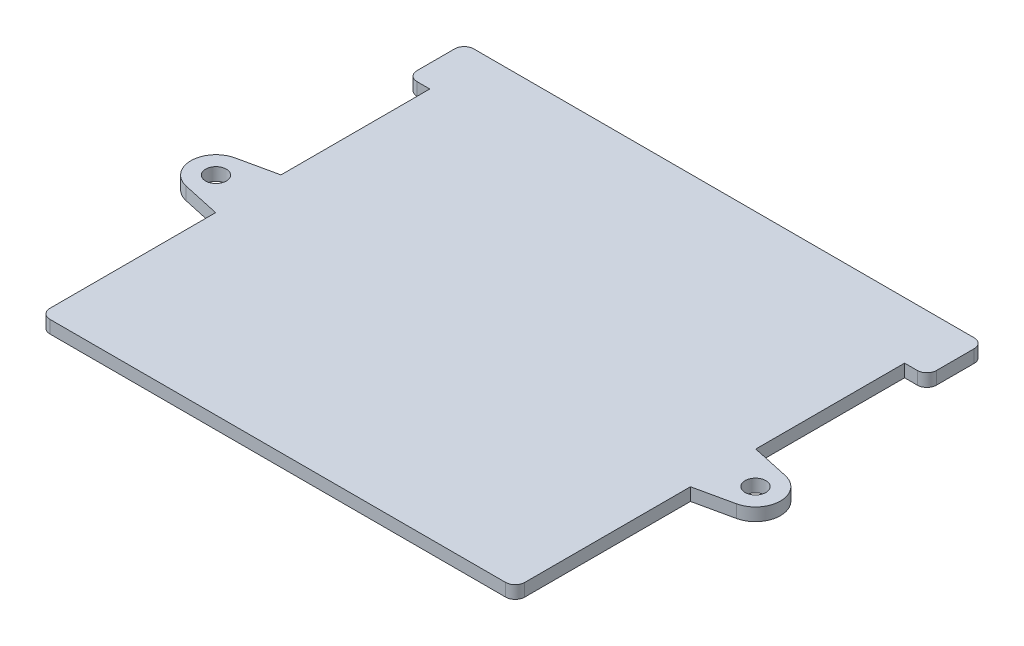
ISO-10303-21;
HEADER;
FILE_DESCRIPTION(('STEP AP214'),'2;1');
FILE_NAME('part.step','',(''),(''),'','','');
FILE_SCHEMA(('AUTOMOTIVE_DESIGN { 1 0 10303 214 1 1 1 1 }'));
ENDSEC;
DATA;
#1=APPLICATION_CONTEXT('core data for automotive mechanical design processes');
#2=APPLICATION_PROTOCOL_DEFINITION('international standard','automotive_design',2000,#1);
#3=PRODUCT_CONTEXT('',#1,'mechanical');
#4=PRODUCT('Part','Part','',(#3));
#5=PRODUCT_RELATED_PRODUCT_CATEGORY('part','',(#4));
#6=PRODUCT_DEFINITION_FORMATION('','',#4);
#7=PRODUCT_DEFINITION_CONTEXT('part definition',#1,'design');
#8=PRODUCT_DEFINITION('design','',#6,#7);
#9=PRODUCT_DEFINITION_SHAPE('','',#8);
#10=(LENGTH_UNIT() NAMED_UNIT(*) SI_UNIT(.MILLI.,.METRE.));
#11=(NAMED_UNIT(*) PLANE_ANGLE_UNIT() SI_UNIT($,.RADIAN.));
#12=(NAMED_UNIT(*) SI_UNIT($,.STERADIAN.) SOLID_ANGLE_UNIT());
#13=UNCERTAINTY_MEASURE_WITH_UNIT(LENGTH_MEASURE(1.E-05),#10,'distance_accuracy_value','');
#14=(GEOMETRIC_REPRESENTATION_CONTEXT(3) GLOBAL_UNCERTAINTY_ASSIGNED_CONTEXT((#13)) GLOBAL_UNIT_ASSIGNED_CONTEXT((#10,
#11,#12)) REPRESENTATION_CONTEXT('',''));
#15=CARTESIAN_POINT('',(0.,0.,0.));
#16=DIRECTION('',(0.,0.,1.));
#17=DIRECTION('',(1.,0.,0.));
#18=AXIS2_PLACEMENT_3D('',#15,#16,#17);
#19=CARTESIAN_POINT('',(84.65,4.,-65.25));
#20=DIRECTION('',(0.,1.,0.));
#21=DIRECTION('',(0.,0.,1.));
#22=AXIS2_PLACEMENT_3D('',#19,#20,#21);
#23=PLANE('',#22);
#24=CARTESIAN_POINT('',(84.65,4.,-65.25));
#25=DIRECTION('',(0.,1.,0.));
#26=DIRECTION('',(0.,0.,1.));
#27=AXIS2_PLACEMENT_3D('',#24,#25,#26);
#28=CIRCLE('',#27,3.25000000000001);
#29=CARTESIAN_POINT('',(84.65,4.,-62.));
#30=VERTEX_POINT('',#29);
#31=EDGE_CURVE('E385',#30,#30,#28,.T.);
#32=ORIENTED_EDGE('',*,*,#31,.F.);
#33=EDGE_LOOP('',(#32));
#34=FACE_BOUND('',#33,.T.);
#35=DIRECTION('',(1.,0.,0.));
#36=VECTOR('',#35,1.);
#37=CARTESIAN_POINT('',(74.5,4.,0.));
#38=LINE('',#37,#36);
#39=CARTESIAN_POINT('',(-71.5,4.,0.));
#40=VERTEX_POINT('',#39);
#41=CARTESIAN_POINT('',(71.5,4.,0.));
#42=VERTEX_POINT('',#41);
#43=EDGE_CURVE('E308',#40,#42,#38,.T.);
#44=ORIENTED_EDGE('',*,*,#43,.T.);
#45=CARTESIAN_POINT('',(71.5,4.,-2.99999999999998));
#46=DIRECTION('',(0.,1.,0.));
#47=DIRECTION('',(0.,0.,1.));
#48=AXIS2_PLACEMENT_3D('',#45,#46,#47);
#49=CIRCLE('',#48,3.);
#50=CARTESIAN_POINT('',(74.5,4.,-2.99999999999998));
#51=VERTEX_POINT('',#50);
#52=EDGE_CURVE('E199',#42,#51,#49,.T.);
#53=ORIENTED_EDGE('',*,*,#52,.T.);
#54=DIRECTION('',(0.,0.,-1.));
#55=VECTOR('',#54,1.);
#56=CARTESIAN_POINT('',(74.5,4.,0.));
#57=LINE('',#56,#55);
#58=CARTESIAN_POINT('',(74.5,4.,-55.));
#59=VERTEX_POINT('',#58);
#60=EDGE_CURVE('E192',#51,#59,#57,.T.);
#61=ORIENTED_EDGE('',*,*,#60,.T.);
#62=DIRECTION('',(0.977002271449129,0.,-0.213228894813161));
#63=VECTOR('',#62,1.);
#64=CARTESIAN_POINT('',(74.5,4.,-55.));
#65=LINE('',#64,#63);
#66=CARTESIAN_POINT('',(86.3238468242833,4.,-57.5805321691243));
#67=VERTEX_POINT('',#66);
#68=EDGE_CURVE('E196',#59,#67,#65,.T.);
#69=ORIENTED_EDGE('',*,*,#68,.T.);
#70=CARTESIAN_POINT('',(84.65,4.,-65.25));
#71=DIRECTION('',(0.,1.,0.));
#72=DIRECTION('',(0.,0.,1.));
#73=AXIS2_PLACEMENT_3D('',#70,#71,#72);
#74=CIRCLE('',#73,7.84999999999999);
#75=CARTESIAN_POINT('',(86.3238468242833,4.,-72.9194678308756));
#76=VERTEX_POINT('',#75);
#77=EDGE_CURVE('E213',#67,#76,#74,.T.);
#78=ORIENTED_EDGE('',*,*,#77,.T.);
#79=DIRECTION('',(-0.977002271449129,0.,-0.213228894813161));
#80=VECTOR('',#79,1.);
#81=CARTESIAN_POINT('',(86.3238468242833,4.,-72.9194678308756));
#82=LINE('',#81,#80);
#83=CARTESIAN_POINT('',(74.5,4.,-75.5));
#84=VERTEX_POINT('',#83);
#85=EDGE_CURVE('E332',#76,#84,#82,.T.);
#86=ORIENTED_EDGE('',*,*,#85,.T.);
#87=DIRECTION('',(0.,0.,-1.));
#88=VECTOR('',#87,1.);
#89=CARTESIAN_POINT('',(74.5,4.,-75.5));
#90=LINE('',#89,#88);
#91=CARTESIAN_POINT('',(74.5,4.,-122.2));
#92=VERTEX_POINT('',#91);
#93=EDGE_CURVE('E388',#84,#92,#90,.T.);
#94=ORIENTED_EDGE('',*,*,#93,.T.);
#95=DIRECTION('',(1.,0.,0.));
#96=VECTOR('',#95,1.);
#97=CARTESIAN_POINT('',(74.5,4.,-122.2));
#98=LINE('',#97,#96);
#99=CARTESIAN_POINT('',(78.5,4.,-122.2));
#100=VERTEX_POINT('',#99);
#101=EDGE_CURVE('E392',#92,#100,#98,.T.);
#102=ORIENTED_EDGE('',*,*,#101,.T.);
#103=CARTESIAN_POINT('',(78.5,4.,-125.2));
#104=DIRECTION('',(0.,1.,0.));
#105=DIRECTION('',(0.,0.,1.));
#106=AXIS2_PLACEMENT_3D('',#103,#104,#105);
#107=CIRCLE('',#106,3.);
#108=CARTESIAN_POINT('',(81.5,4.,-125.2));
#109=VERTEX_POINT('',#108);
#110=EDGE_CURVE('E250',#100,#109,#107,.T.);
#111=ORIENTED_EDGE('',*,*,#110,.T.);
#112=DIRECTION('',(0.,0.,-1.));
#113=VECTOR('',#112,1.);
#114=CARTESIAN_POINT('',(81.5,4.,-122.2));
#115=LINE('',#114,#113);
#116=CARTESIAN_POINT('',(81.5,4.,-137.));
#117=VERTEX_POINT('',#116);
#118=EDGE_CURVE('E371',#109,#117,#115,.T.);
#119=ORIENTED_EDGE('',*,*,#118,.T.);
#120=CARTESIAN_POINT('',(78.5,4.,-137.));
#121=DIRECTION('',(0.,1.,0.));
#122=DIRECTION('',(0.,0.,1.));
#123=AXIS2_PLACEMENT_3D('',#120,#121,#122);
#124=CIRCLE('',#123,3.);
#125=CARTESIAN_POINT('',(78.5,4.,-140.));
#126=VERTEX_POINT('',#125);
#127=EDGE_CURVE('E248',#117,#126,#124,.T.);
#128=ORIENTED_EDGE('',*,*,#127,.T.);
#129=DIRECTION('',(-1.,0.,0.));
#130=VECTOR('',#129,1.);
#131=CARTESIAN_POINT('',(-81.5,4.,-140.));
#132=LINE('',#131,#130);
#133=CARTESIAN_POINT('',(-78.5,4.,-140.));
#134=VERTEX_POINT('',#133);
#135=EDGE_CURVE('E364',#126,#134,#132,.T.);
#136=ORIENTED_EDGE('',*,*,#135,.T.);
#137=CARTESIAN_POINT('',(-78.5,4.,-137.));
#138=DIRECTION('',(0.,1.,0.));
#139=DIRECTION('',(0.,0.,1.));
#140=AXIS2_PLACEMENT_3D('',#137,#138,#139);
#141=CIRCLE('',#140,3.);
#142=CARTESIAN_POINT('',(-81.5,4.,-137.));
#143=VERTEX_POINT('',#142);
#144=EDGE_CURVE('E246',#134,#143,#141,.T.);
#145=ORIENTED_EDGE('',*,*,#144,.T.);
#146=DIRECTION('',(0.,0.,1.));
#147=VECTOR('',#146,1.);
#148=CARTESIAN_POINT('',(-81.5,4.,-122.2));
#149=LINE('',#148,#147);
#150=CARTESIAN_POINT('',(-81.5,4.,-125.2));
#151=VERTEX_POINT('',#150);
#152=EDGE_CURVE('E363',#143,#151,#149,.T.);
#153=ORIENTED_EDGE('',*,*,#152,.T.);
#154=CARTESIAN_POINT('',(-78.5,4.,-125.2));
#155=DIRECTION('',(0.,1.,0.));
#156=DIRECTION('',(0.,0.,1.));
#157=AXIS2_PLACEMENT_3D('',#154,#155,#156);
#158=CIRCLE('',#157,3.);
#159=CARTESIAN_POINT('',(-78.5,4.,-122.2));
#160=VERTEX_POINT('',#159);
#161=EDGE_CURVE('E65',#151,#160,#158,.T.);
#162=ORIENTED_EDGE('',*,*,#161,.T.);
#163=DIRECTION('',(1.,0.,0.));
#164=VECTOR('',#163,1.);
#165=CARTESIAN_POINT('',(-74.5,4.,-122.2));
#166=LINE('',#165,#164);
#167=CARTESIAN_POINT('',(-74.5,4.,-122.2));
#168=VERTEX_POINT('',#167);
#169=EDGE_CURVE('E277',#160,#168,#166,.T.);
#170=ORIENTED_EDGE('',*,*,#169,.T.);
#171=DIRECTION('',(0.,0.,1.));
#172=VECTOR('',#171,1.);
#173=CARTESIAN_POINT('',(-74.5,4.,-75.5));
#174=LINE('',#173,#172);
#175=CARTESIAN_POINT('',(-74.5,4.,-75.5));
#176=VERTEX_POINT('',#175);
#177=EDGE_CURVE('E369',#168,#176,#174,.T.);
#178=ORIENTED_EDGE('',*,*,#177,.T.);
#179=DIRECTION('',(-0.97700227144913,0.,0.213228894813159));
#180=VECTOR('',#179,1.);
#181=CARTESIAN_POINT('',(-86.3238468242833,4.,-72.9194678308757));
#182=LINE('',#181,#180);
#183=CARTESIAN_POINT('',(-86.3238468242833,4.,-72.9194678308756));
#184=VERTEX_POINT('',#183);
#185=EDGE_CURVE('E376',#176,#184,#182,.T.);
#186=ORIENTED_EDGE('',*,*,#185,.T.);
#187=CARTESIAN_POINT('',(-84.65,4.,-65.25));
#188=DIRECTION('',(0.,1.,0.));
#189=DIRECTION('',(0.,0.,-1.));
#190=AXIS2_PLACEMENT_3D('',#187,#188,#189);
#191=CIRCLE('',#190,7.85);
#192=CARTESIAN_POINT('',(-86.3238468242833,4.,-57.5805321691243));
#193=VERTEX_POINT('',#192);
#194=EDGE_CURVE('E378',#184,#193,#191,.T.);
#195=ORIENTED_EDGE('',*,*,#194,.T.);
#196=DIRECTION('',(0.977002271449129,0.,0.213228894813161));
#197=VECTOR('',#196,1.);
#198=CARTESIAN_POINT('',(-74.5,4.,-55.));
#199=LINE('',#198,#197);
#200=CARTESIAN_POINT('',(-74.5,4.,-55.));
#201=VERTEX_POINT('',#200);
#202=EDGE_CURVE('E380',#193,#201,#199,.T.);
#203=ORIENTED_EDGE('',*,*,#202,.T.);
#204=DIRECTION('',(0.,0.,1.));
#205=VECTOR('',#204,1.);
#206=CARTESIAN_POINT('',(-74.5,4.,0.));
#207=LINE('',#206,#205);
#208=CARTESIAN_POINT('',(-74.5,4.,-2.99999999999998));
#209=VERTEX_POINT('',#208);
#210=EDGE_CURVE('E382',#201,#209,#207,.T.);
#211=ORIENTED_EDGE('',*,*,#210,.T.);
#212=CARTESIAN_POINT('',(-71.5,4.,-2.99999999999998));
#213=DIRECTION('',(0.,1.,0.));
#214=DIRECTION('',(0.,0.,1.));
#215=AXIS2_PLACEMENT_3D('',#212,#213,#214);
#216=CIRCLE('',#215,3.);
#217=EDGE_CURVE('E243',#209,#40,#216,.T.);
#218=ORIENTED_EDGE('',*,*,#217,.T.);
#219=EDGE_LOOP('',(#44,#53,#61,#69,#78,#86,#94,#102,#111,#119,#128,#136,#145,#153,#162,#170,
#178,#186,#195,#203,#211,#218));
#220=FACE_BOUND('',#219,.T.);
#221=CARTESIAN_POINT('',(-84.65,4.,-65.25));
#222=DIRECTION('',(0.,1.,0.));
#223=DIRECTION('',(0.,0.,1.));
#224=AXIS2_PLACEMENT_3D('',#221,#222,#223);
#225=CIRCLE('',#224,3.25000000000001);
#226=CARTESIAN_POINT('',(-84.65,4.,-62.));
#227=VERTEX_POINT('',#226);
#228=EDGE_CURVE('E661',#227,#227,#225,.T.);
#229=ORIENTED_EDGE('',*,*,#228,.F.);
#230=EDGE_LOOP('',(#229));
#231=FACE_BOUND('',#230,.T.);
#232=ADVANCED_FACE('F44',(#34,#220,#231),#23,.T.);
#233=CARTESIAN_POINT('',(84.65,0.,-65.25));
#234=DIRECTION('',(0.,1.,0.));
#235=DIRECTION('',(0.,0.,1.));
#236=AXIS2_PLACEMENT_3D('',#233,#234,#235);
#237=PLANE('',#236);
#238=DIRECTION('',(0.,0.,-1.));
#239=VECTOR('',#238,1.);
#240=CARTESIAN_POINT('',(74.5,0.,0.));
#241=LINE('',#240,#239);
#242=CARTESIAN_POINT('',(74.5,0.,-2.99999999999998));
#243=VERTEX_POINT('',#242);
#244=CARTESIAN_POINT('',(74.5,0.,-55.));
#245=VERTEX_POINT('',#244);
#246=EDGE_CURVE('E217',#243,#245,#241,.T.);
#247=ORIENTED_EDGE('',*,*,#246,.F.);
#248=CARTESIAN_POINT('',(71.5,0.,-2.99999999999998));
#249=DIRECTION('',(0.,1.,0.));
#250=DIRECTION('',(0.,0.,1.));
#251=AXIS2_PLACEMENT_3D('',#248,#249,#250);
#252=CIRCLE('',#251,3.);
#253=CARTESIAN_POINT('',(71.5,0.,0.));
#254=VERTEX_POINT('',#253);
#255=EDGE_CURVE('E236',#243,#254,#252,.F.);
#256=ORIENTED_EDGE('',*,*,#255,.T.);
#257=DIRECTION('',(1.,0.,0.));
#258=VECTOR('',#257,1.);
#259=CARTESIAN_POINT('',(74.5,0.,0.));
#260=LINE('',#259,#258);
#261=CARTESIAN_POINT('',(-71.5,0.,0.));
#262=VERTEX_POINT('',#261);
#263=EDGE_CURVE('E204',#262,#254,#260,.T.);
#264=ORIENTED_EDGE('',*,*,#263,.F.);
#265=CARTESIAN_POINT('',(-71.5,0.,-2.99999999999998));
#266=DIRECTION('',(0.,1.,0.));
#267=DIRECTION('',(0.,0.,1.));
#268=AXIS2_PLACEMENT_3D('',#265,#266,#267);
#269=CIRCLE('',#268,3.);
#270=CARTESIAN_POINT('',(-74.5,0.,-2.99999999999998));
#271=VERTEX_POINT('',#270);
#272=EDGE_CURVE('E221',#262,#271,#269,.F.);
#273=ORIENTED_EDGE('',*,*,#272,.T.);
#274=DIRECTION('',(0.,0.,1.));
#275=VECTOR('',#274,1.);
#276=CARTESIAN_POINT('',(-74.5,0.,0.));
#277=LINE('',#276,#275);
#278=CARTESIAN_POINT('',(-74.5,0.,-55.));
#279=VERTEX_POINT('',#278);
#280=EDGE_CURVE('E300',#279,#271,#277,.T.);
#281=ORIENTED_EDGE('',*,*,#280,.F.);
#282=DIRECTION('',(0.977002271449129,0.,0.213228894813161));
#283=VECTOR('',#282,1.);
#284=CARTESIAN_POINT('',(-74.5,0.,-55.));
#285=LINE('',#284,#283);
#286=CARTESIAN_POINT('',(-86.3238468242833,0.,-57.5805321691243));
#287=VERTEX_POINT('',#286);
#288=EDGE_CURVE('E298',#287,#279,#285,.T.);
#289=ORIENTED_EDGE('',*,*,#288,.F.);
#290=CARTESIAN_POINT('',(-84.65,0.,-65.25));
#291=DIRECTION('',(0.,1.,0.));
#292=DIRECTION('',(0.,0.,-1.));
#293=AXIS2_PLACEMENT_3D('',#290,#291,#292);
#294=CIRCLE('',#293,7.85);
#295=CARTESIAN_POINT('',(-86.3238468242833,0.,-72.9194678308756));
#296=VERTEX_POINT('',#295);
#297=EDGE_CURVE('E296',#296,#287,#294,.T.);
#298=ORIENTED_EDGE('',*,*,#297,.F.);
#299=DIRECTION('',(-0.97700227144913,0.,0.213228894813159));
#300=VECTOR('',#299,1.);
#301=CARTESIAN_POINT('',(-86.3238468242833,0.,-72.9194678308757));
#302=LINE('',#301,#300);
#303=CARTESIAN_POINT('',(-74.5,0.,-75.5));
#304=VERTEX_POINT('',#303);
#305=EDGE_CURVE('E289',#304,#296,#302,.T.);
#306=ORIENTED_EDGE('',*,*,#305,.F.);
#307=DIRECTION('',(0.,0.,1.));
#308=VECTOR('',#307,1.);
#309=CARTESIAN_POINT('',(-74.5,0.,-75.5));
#310=LINE('',#309,#308);
#311=CARTESIAN_POINT('',(-74.5,0.,-122.2));
#312=VERTEX_POINT('',#311);
#313=EDGE_CURVE('E286',#312,#304,#310,.T.);
#314=ORIENTED_EDGE('',*,*,#313,.F.);
#315=DIRECTION('',(1.,0.,0.));
#316=VECTOR('',#315,1.);
#317=CARTESIAN_POINT('',(-74.5,0.,-122.2));
#318=LINE('',#317,#316);
#319=CARTESIAN_POINT('',(-78.5,0.,-122.2));
#320=VERTEX_POINT('',#319);
#321=EDGE_CURVE('E275',#320,#312,#318,.T.);
#322=ORIENTED_EDGE('',*,*,#321,.F.);
#323=CARTESIAN_POINT('',(-78.5,0.,-125.2));
#324=DIRECTION('',(0.,1.,0.));
#325=DIRECTION('',(0.,0.,1.));
#326=AXIS2_PLACEMENT_3D('',#323,#324,#325);
#327=CIRCLE('',#326,3.);
#328=CARTESIAN_POINT('',(-81.5,0.,-125.2));
#329=VERTEX_POINT('',#328);
#330=EDGE_CURVE('E228',#320,#329,#327,.F.);
#331=ORIENTED_EDGE('',*,*,#330,.T.);
#332=DIRECTION('',(0.,0.,1.));
#333=VECTOR('',#332,1.);
#334=CARTESIAN_POINT('',(-81.5,0.,-122.2));
#335=LINE('',#334,#333);
#336=CARTESIAN_POINT('',(-81.5,0.,-137.));
#337=VERTEX_POINT('',#336);
#338=EDGE_CURVE('E287',#337,#329,#335,.T.);
#339=ORIENTED_EDGE('',*,*,#338,.F.);
#340=CARTESIAN_POINT('',(-78.5,0.,-137.));
#341=DIRECTION('',(0.,1.,0.));
#342=DIRECTION('',(0.,0.,1.));
#343=AXIS2_PLACEMENT_3D('',#340,#341,#342);
#344=CIRCLE('',#343,3.);
#345=CARTESIAN_POINT('',(-78.5,0.,-140.));
#346=VERTEX_POINT('',#345);
#347=EDGE_CURVE('E230',#337,#346,#344,.F.);
#348=ORIENTED_EDGE('',*,*,#347,.T.);
#349=DIRECTION('',(-1.,0.,0.));
#350=VECTOR('',#349,1.);
#351=CARTESIAN_POINT('',(-81.5,0.,-140.));
#352=LINE('',#351,#350);
#353=CARTESIAN_POINT('',(78.5,0.,-140.));
#354=VERTEX_POINT('',#353);
#355=EDGE_CURVE('E291',#354,#346,#352,.T.);
#356=ORIENTED_EDGE('',*,*,#355,.F.);
#357=CARTESIAN_POINT('',(78.5,0.,-137.));
#358=DIRECTION('',(0.,1.,0.));
#359=DIRECTION('',(0.,0.,1.));
#360=AXIS2_PLACEMENT_3D('',#357,#358,#359);
#361=CIRCLE('',#360,3.);
#362=CARTESIAN_POINT('',(81.5,0.,-137.));
#363=VERTEX_POINT('',#362);
#364=EDGE_CURVE('E232',#354,#363,#361,.F.);
#365=ORIENTED_EDGE('',*,*,#364,.T.);
#366=DIRECTION('',(0.,0.,-1.));
#367=VECTOR('',#366,1.);
#368=CARTESIAN_POINT('',(81.5,0.,-122.2));
#369=LINE('',#368,#367);
#370=CARTESIAN_POINT('',(81.5,0.,-125.2));
#371=VERTEX_POINT('',#370);
#372=EDGE_CURVE('E348',#371,#363,#369,.T.);
#373=ORIENTED_EDGE('',*,*,#372,.F.);
#374=CARTESIAN_POINT('',(78.5,0.,-125.2));
#375=DIRECTION('',(0.,1.,0.));
#376=DIRECTION('',(0.,0.,1.));
#377=AXIS2_PLACEMENT_3D('',#374,#375,#376);
#378=CIRCLE('',#377,3.);
#379=CARTESIAN_POINT('',(78.5,0.,-122.2));
#380=VERTEX_POINT('',#379);
#381=EDGE_CURVE('E234',#371,#380,#378,.F.);
#382=ORIENTED_EDGE('',*,*,#381,.T.);
#383=DIRECTION('',(1.,0.,0.));
#384=VECTOR('',#383,1.);
#385=CARTESIAN_POINT('',(74.5,0.,-122.2));
#386=LINE('',#385,#384);
#387=CARTESIAN_POINT('',(74.5,0.,-122.2));
#388=VERTEX_POINT('',#387);
#389=EDGE_CURVE('E340',#388,#380,#386,.T.);
#390=ORIENTED_EDGE('',*,*,#389,.F.);
#391=DIRECTION('',(0.,0.,-1.));
#392=VECTOR('',#391,1.);
#393=CARTESIAN_POINT('',(74.5,0.,-75.5));
#394=LINE('',#393,#392);
#395=CARTESIAN_POINT('',(74.5,0.,-75.5));
#396=VERTEX_POINT('',#395);
#397=EDGE_CURVE('E338',#396,#388,#394,.T.);
#398=ORIENTED_EDGE('',*,*,#397,.F.);
#399=DIRECTION('',(-0.977002271449129,0.,-0.213228894813161));
#400=VECTOR('',#399,1.);
#401=CARTESIAN_POINT('',(86.3238468242833,0.,-72.9194678308756));
#402=LINE('',#401,#400);
#403=CARTESIAN_POINT('',(86.3238468242833,0.,-72.9194678308756));
#404=VERTEX_POINT('',#403);
#405=EDGE_CURVE('E331',#404,#396,#402,.T.);
#406=ORIENTED_EDGE('',*,*,#405,.F.);
#407=CARTESIAN_POINT('',(84.65,0.,-65.25));
#408=DIRECTION('',(0.,1.,0.));
#409=DIRECTION('',(0.,0.,1.));
#410=AXIS2_PLACEMENT_3D('',#407,#408,#409);
#411=CIRCLE('',#410,7.84999999999999);
#412=CARTESIAN_POINT('',(86.3238468242833,0.,-57.5805321691243));
#413=VERTEX_POINT('',#412);
#414=EDGE_CURVE('E336',#413,#404,#411,.T.);
#415=ORIENTED_EDGE('',*,*,#414,.F.);
#416=DIRECTION('',(0.977002271449129,0.,-0.213228894813161));
#417=VECTOR('',#416,1.);
#418=CARTESIAN_POINT('',(74.5,0.,-55.));
#419=LINE('',#418,#417);
#420=EDGE_CURVE('E342',#245,#413,#419,.T.);
#421=ORIENTED_EDGE('',*,*,#420,.F.);
#422=EDGE_LOOP('',(#247,#256,#264,#273,#281,#289,#298,#306,#314,#322,#331,#339,#348,#356,#365,
#373,#382,#390,#398,#406,#415,#421));
#423=FACE_BOUND('',#422,.T.);
#424=CARTESIAN_POINT('',(84.65,0.,-65.25));
#425=DIRECTION('',(0.,1.,0.));
#426=DIRECTION('',(0.,0.,1.));
#427=AXIS2_PLACEMENT_3D('',#424,#425,#426);
#428=CIRCLE('',#427,3.25000000000001);
#429=CARTESIAN_POINT('',(84.65,0.,-62.));
#430=VERTEX_POINT('',#429);
#431=EDGE_CURVE('E667',#430,#430,#428,.T.);
#432=ORIENTED_EDGE('',*,*,#431,.T.);
#433=EDGE_LOOP('',(#432));
#434=FACE_BOUND('',#433,.T.);
#435=CARTESIAN_POINT('',(-84.65,0.,-65.25));
#436=DIRECTION('',(0.,1.,0.));
#437=DIRECTION('',(0.,0.,1.));
#438=AXIS2_PLACEMENT_3D('',#435,#436,#437);
#439=CIRCLE('',#438,3.25000000000001);
#440=CARTESIAN_POINT('',(-84.65,0.,-62.));
#441=VERTEX_POINT('',#440);
#442=EDGE_CURVE('E664',#441,#441,#439,.T.);
#443=ORIENTED_EDGE('',*,*,#442,.T.);
#444=EDGE_LOOP('',(#443));
#445=FACE_BOUND('',#444,.T.);
#446=ADVANCED_FACE('F281',(#423,#434,#445),#237,.F.);
#447=CARTESIAN_POINT('',(74.5,4.,0.));
#448=DIRECTION('',(-1.,0.,0.));
#449=DIRECTION('',(0.,0.,1.));
#450=AXIS2_PLACEMENT_3D('',#447,#448,#449);
#451=PLANE('',#450);
#452=ORIENTED_EDGE('',*,*,#60,.F.);
#453=DIRECTION('',(0.,-1.,0.));
#454=VECTOR('',#453,1.);
#455=CARTESIAN_POINT('',(74.5,4.,-2.99999999999998));
#456=LINE('',#455,#454);
#457=EDGE_CURVE('E219',#51,#243,#456,.T.);
#458=ORIENTED_EDGE('',*,*,#457,.T.);
#459=ORIENTED_EDGE('',*,*,#246,.T.);
#460=DIRECTION('',(0.,-1.,0.));
#461=VECTOR('',#460,1.);
#462=CARTESIAN_POINT('',(74.5,4.,-55.));
#463=LINE('',#462,#461);
#464=EDGE_CURVE('E209',#59,#245,#463,.T.);
#465=ORIENTED_EDGE('',*,*,#464,.F.);
#466=EDGE_LOOP('',(#452,#458,#459,#465));
#467=FACE_BOUND('',#466,.T.);
#468=ADVANCED_FACE('F215',(#467),#451,.F.);
#469=CARTESIAN_POINT('',(74.5,4.,-55.));
#470=DIRECTION('',(-0.213228894813161,0.,-0.977002271449129));
#471=DIRECTION('',(-0.977002271449129,0.,0.213228894813161));
#472=AXIS2_PLACEMENT_3D('',#469,#470,#471);
#473=PLANE('',#472);
#474=ORIENTED_EDGE('',*,*,#420,.T.);
#475=DIRECTION('',(0.,-1.,0.));
#476=VECTOR('',#475,1.);
#477=CARTESIAN_POINT('',(86.3238468242833,4.,-57.5805321691243));
#478=LINE('',#477,#476);
#479=EDGE_CURVE('E211',#67,#413,#478,.T.);
#480=ORIENTED_EDGE('',*,*,#479,.F.);
#481=ORIENTED_EDGE('',*,*,#68,.F.);
#482=ORIENTED_EDGE('',*,*,#464,.T.);
#483=EDGE_LOOP('',(#474,#480,#481,#482));
#484=FACE_BOUND('',#483,.T.);
#485=ADVANCED_FACE('F208',(#484),#473,.F.);
#486=CARTESIAN_POINT('',(84.65,4.,-65.25));
#487=DIRECTION('',(0.,-1.,0.));
#488=DIRECTION('',(0.,0.,-1.));
#489=AXIS2_PLACEMENT_3D('',#486,#487,#488);
#490=CYLINDRICAL_SURFACE('',#489,7.84999999999999);
#491=ORIENTED_EDGE('',*,*,#414,.T.);
#492=DIRECTION('',(0.,-1.,0.));
#493=VECTOR('',#492,1.);
#494=CARTESIAN_POINT('',(86.3238468242833,4.,-72.9194678308756));
#495=LINE('',#494,#493);
#496=EDGE_CURVE('E223',#76,#404,#495,.T.);
#497=ORIENTED_EDGE('',*,*,#496,.F.);
#498=ORIENTED_EDGE('',*,*,#77,.F.);
#499=ORIENTED_EDGE('',*,*,#479,.T.);
#500=EDGE_LOOP('',(#491,#497,#498,#499));
#501=FACE_BOUND('',#500,.T.);
#502=ADVANCED_FACE('F386',(#501),#490,.T.);
#503=CARTESIAN_POINT('',(86.3238468242833,4.,-72.9194678308756));
#504=DIRECTION('',(-0.213228894813161,0.,0.977002271449129));
#505=DIRECTION('',(0.977002271449129,0.,0.213228894813161));
#506=AXIS2_PLACEMENT_3D('',#503,#504,#505);
#507=PLANE('',#506);
#508=ORIENTED_EDGE('',*,*,#405,.T.);
#509=DIRECTION('',(0.,-1.,0.));
#510=VECTOR('',#509,1.);
#511=CARTESIAN_POINT('',(74.5,4.,-75.5));
#512=LINE('',#511,#510);
#513=EDGE_CURVE('E322',#84,#396,#512,.T.);
#514=ORIENTED_EDGE('',*,*,#513,.F.);
#515=ORIENTED_EDGE('',*,*,#85,.F.);
#516=ORIENTED_EDGE('',*,*,#496,.T.);
#517=EDGE_LOOP('',(#508,#514,#515,#516));
#518=FACE_BOUND('',#517,.T.);
#519=ADVANCED_FACE('F329',(#518),#507,.F.);
#520=CARTESIAN_POINT('',(74.5,4.,-75.5));
#521=DIRECTION('',(-1.,0.,0.));
#522=DIRECTION('',(0.,0.,1.));
#523=AXIS2_PLACEMENT_3D('',#520,#521,#522);
#524=PLANE('',#523);
#525=ORIENTED_EDGE('',*,*,#397,.T.);
#526=DIRECTION('',(0.,-1.,0.));
#527=VECTOR('',#526,1.);
#528=CARTESIAN_POINT('',(74.5,4.,-122.2));
#529=LINE('',#528,#527);
#530=EDGE_CURVE('E319',#92,#388,#529,.T.);
#531=ORIENTED_EDGE('',*,*,#530,.F.);
#532=ORIENTED_EDGE('',*,*,#93,.F.);
#533=ORIENTED_EDGE('',*,*,#513,.T.);
#534=EDGE_LOOP('',(#525,#531,#532,#533));
#535=FACE_BOUND('',#534,.T.);
#536=ADVANCED_FACE('F414',(#535),#524,.F.);
#537=CARTESIAN_POINT('',(74.5,4.,-122.2));
#538=DIRECTION('',(0.,0.,-1.));
#539=DIRECTION('',(-1.,0.,0.));
#540=AXIS2_PLACEMENT_3D('',#537,#538,#539);
#541=PLANE('',#540);
#542=ORIENTED_EDGE('',*,*,#389,.T.);
#543=DIRECTION('',(0.,-1.,0.));
#544=VECTOR('',#543,1.);
#545=CARTESIAN_POINT('',(78.5,4.,-122.2));
#546=LINE('',#545,#544);
#547=EDGE_CURVE('E258',#380,#100,#546,.F.);
#548=ORIENTED_EDGE('',*,*,#547,.T.);
#549=ORIENTED_EDGE('',*,*,#101,.F.);
#550=ORIENTED_EDGE('',*,*,#530,.T.);
#551=EDGE_LOOP('',(#542,#548,#549,#550));
#552=FACE_BOUND('',#551,.T.);
#553=ADVANCED_FACE('F409',(#552),#541,.F.);
#554=CARTESIAN_POINT('',(81.5,4.,-122.2));
#555=DIRECTION('',(-1.,0.,0.));
#556=DIRECTION('',(0.,0.,1.));
#557=AXIS2_PLACEMENT_3D('',#554,#555,#556);
#558=PLANE('',#557);
#559=ORIENTED_EDGE('',*,*,#118,.F.);
#560=DIRECTION('',(0.,-1.,0.));
#561=VECTOR('',#560,1.);
#562=CARTESIAN_POINT('',(81.5,4.,-125.2));
#563=LINE('',#562,#561);
#564=EDGE_CURVE('E255',#109,#371,#563,.T.);
#565=ORIENTED_EDGE('',*,*,#564,.T.);
#566=ORIENTED_EDGE('',*,*,#372,.T.);
#567=DIRECTION('',(0.,-1.,0.));
#568=VECTOR('',#567,1.);
#569=CARTESIAN_POINT('',(81.5,4.,-137.));
#570=LINE('',#569,#568);
#571=EDGE_CURVE('E253',#363,#117,#570,.F.);
#572=ORIENTED_EDGE('',*,*,#571,.T.);
#573=EDGE_LOOP('',(#559,#565,#566,#572));
#574=FACE_BOUND('',#573,.T.);
#575=ADVANCED_FACE('F404',(#574),#558,.F.);
#576=CARTESIAN_POINT('',(-81.5,4.,-140.));
#577=DIRECTION('',(0.,0.,1.));
#578=DIRECTION('',(1.,0.,0.));
#579=AXIS2_PLACEMENT_3D('',#576,#577,#578);
#580=PLANE('',#579);
#581=ORIENTED_EDGE('',*,*,#135,.F.);
#582=DIRECTION('',(0.,-1.,0.));
#583=VECTOR('',#582,1.);
#584=CARTESIAN_POINT('',(78.5,4.,-140.));
#585=LINE('',#584,#583);
#586=EDGE_CURVE('E262',#126,#354,#585,.T.);
#587=ORIENTED_EDGE('',*,*,#586,.T.);
#588=ORIENTED_EDGE('',*,*,#355,.T.);
#589=DIRECTION('',(0.,-1.,0.));
#590=VECTOR('',#589,1.);
#591=CARTESIAN_POINT('',(-78.5,4.,-140.));
#592=LINE('',#591,#590);
#593=EDGE_CURVE('E260',#346,#134,#592,.F.);
#594=ORIENTED_EDGE('',*,*,#593,.T.);
#595=EDGE_LOOP('',(#581,#587,#588,#594));
#596=FACE_BOUND('',#595,.T.);
#597=ADVANCED_FACE('F355',(#596),#580,.F.);
#598=CARTESIAN_POINT('',(-81.5,4.,-122.2));
#599=DIRECTION('',(1.,0.,0.));
#600=DIRECTION('',(0.,0.,-1.));
#601=AXIS2_PLACEMENT_3D('',#598,#599,#600);
#602=PLANE('',#601);
#603=ORIENTED_EDGE('',*,*,#152,.F.);
#604=DIRECTION('',(0.,-1.,0.));
#605=VECTOR('',#604,1.);
#606=CARTESIAN_POINT('',(-81.5,4.,-137.));
#607=LINE('',#606,#605);
#608=EDGE_CURVE('E267',#143,#337,#607,.T.);
#609=ORIENTED_EDGE('',*,*,#608,.T.);
#610=ORIENTED_EDGE('',*,*,#338,.T.);
#611=DIRECTION('',(0.,-1.,0.));
#612=VECTOR('',#611,1.);
#613=CARTESIAN_POINT('',(-81.5,4.,-125.2));
#614=LINE('',#613,#612);
#615=EDGE_CURVE('E265',#329,#151,#614,.F.);
#616=ORIENTED_EDGE('',*,*,#615,.T.);
#617=EDGE_LOOP('',(#603,#609,#610,#616));
#618=FACE_BOUND('',#617,.T.);
#619=ADVANCED_FACE('F366',(#618),#602,.F.);
#620=CARTESIAN_POINT('',(-74.5,4.,-122.2));
#621=DIRECTION('',(0.,0.,-1.));
#622=DIRECTION('',(-1.,0.,0.));
#623=AXIS2_PLACEMENT_3D('',#620,#621,#622);
#624=PLANE('',#623);
#625=ORIENTED_EDGE('',*,*,#169,.F.);
#626=DIRECTION('',(0.,-1.,0.));
#627=VECTOR('',#626,1.);
#628=CARTESIAN_POINT('',(-78.5,4.,-122.2));
#629=LINE('',#628,#627);
#630=EDGE_CURVE('E52',#160,#320,#629,.T.);
#631=ORIENTED_EDGE('',*,*,#630,.T.);
#632=ORIENTED_EDGE('',*,*,#321,.T.);
#633=DIRECTION('',(0.,-1.,0.));
#634=VECTOR('',#633,1.);
#635=CARTESIAN_POINT('',(-74.5,4.,-122.2));
#636=LINE('',#635,#634);
#637=EDGE_CURVE('E317',#168,#312,#636,.T.);
#638=ORIENTED_EDGE('',*,*,#637,.F.);
#639=EDGE_LOOP('',(#625,#631,#632,#638));
#640=FACE_BOUND('',#639,.T.);
#641=ADVANCED_FACE('F273',(#640),#624,.F.);
#642=CARTESIAN_POINT('',(-74.5,4.,-75.5));
#643=DIRECTION('',(1.,0.,0.));
#644=DIRECTION('',(0.,0.,-1.));
#645=AXIS2_PLACEMENT_3D('',#642,#643,#644);
#646=PLANE('',#645);
#647=ORIENTED_EDGE('',*,*,#313,.T.);
#648=DIRECTION('',(0.,-1.,0.));
#649=VECTOR('',#648,1.);
#650=CARTESIAN_POINT('',(-74.5,4.,-75.5));
#651=LINE('',#650,#649);
#652=EDGE_CURVE('E314',#176,#304,#651,.T.);
#653=ORIENTED_EDGE('',*,*,#652,.F.);
#654=ORIENTED_EDGE('',*,*,#177,.F.);
#655=ORIENTED_EDGE('',*,*,#637,.T.);
#656=EDGE_LOOP('',(#647,#653,#654,#655));
#657=FACE_BOUND('',#656,.T.);
#658=ADVANCED_FACE('F453',(#657),#646,.F.);
#659=CARTESIAN_POINT('',(-86.3238468242833,4.,-72.9194678308757));
#660=DIRECTION('',(0.213228894813159,0.,0.97700227144913));
#661=DIRECTION('',(0.97700227144913,0.,-0.213228894813159));
#662=AXIS2_PLACEMENT_3D('',#659,#660,#661);
#663=PLANE('',#662);
#664=ORIENTED_EDGE('',*,*,#305,.T.);
#665=DIRECTION('',(0.,-1.,0.));
#666=VECTOR('',#665,1.);
#667=CARTESIAN_POINT('',(-86.3238468242833,4.,-72.9194678308756));
#668=LINE('',#667,#666);
#669=EDGE_CURVE('E311',#184,#296,#668,.T.);
#670=ORIENTED_EDGE('',*,*,#669,.F.);
#671=ORIENTED_EDGE('',*,*,#185,.F.);
#672=ORIENTED_EDGE('',*,*,#652,.T.);
#673=EDGE_LOOP('',(#664,#670,#671,#672));
#674=FACE_BOUND('',#673,.T.);
#675=ADVANCED_FACE('F449',(#674),#663,.F.);
#676=CARTESIAN_POINT('',(-84.65,4.,-65.25));
#677=DIRECTION('',(0.,-1.,0.));
#678=DIRECTION('',(0.,0.,-1.));
#679=AXIS2_PLACEMENT_3D('',#676,#677,#678);
#680=CYLINDRICAL_SURFACE('',#679,7.85);
#681=ORIENTED_EDGE('',*,*,#297,.T.);
#682=DIRECTION('',(0.,-1.,0.));
#683=VECTOR('',#682,1.);
#684=CARTESIAN_POINT('',(-86.3238468242833,4.,-57.5805321691243));
#685=LINE('',#684,#683);
#686=EDGE_CURVE('E307',#193,#287,#685,.T.);
#687=ORIENTED_EDGE('',*,*,#686,.F.);
#688=ORIENTED_EDGE('',*,*,#194,.F.);
#689=ORIENTED_EDGE('',*,*,#669,.T.);
#690=EDGE_LOOP('',(#681,#687,#688,#689));
#691=FACE_BOUND('',#690,.T.);
#692=ADVANCED_FACE('F445',(#691),#680,.T.);
#693=CARTESIAN_POINT('',(-74.5,4.,-55.));
#694=DIRECTION('',(0.213228894813161,0.,-0.977002271449129));
#695=DIRECTION('',(-0.977002271449129,0.,-0.213228894813161));
#696=AXIS2_PLACEMENT_3D('',#693,#694,#695);
#697=PLANE('',#696);
#698=ORIENTED_EDGE('',*,*,#288,.T.);
#699=DIRECTION('',(0.,-1.,0.));
#700=VECTOR('',#699,1.);
#701=CARTESIAN_POINT('',(-74.5,4.,-55.));
#702=LINE('',#701,#700);
#703=EDGE_CURVE('E304',#201,#279,#702,.T.);
#704=ORIENTED_EDGE('',*,*,#703,.F.);
#705=ORIENTED_EDGE('',*,*,#202,.F.);
#706=ORIENTED_EDGE('',*,*,#686,.T.);
#707=EDGE_LOOP('',(#698,#704,#705,#706));
#708=FACE_BOUND('',#707,.T.);
#709=ADVANCED_FACE('F442',(#708),#697,.F.);
#710=CARTESIAN_POINT('',(-74.5,4.,0.));
#711=DIRECTION('',(1.,0.,0.));
#712=DIRECTION('',(0.,0.,-1.));
#713=AXIS2_PLACEMENT_3D('',#710,#711,#712);
#714=PLANE('',#713);
#715=ORIENTED_EDGE('',*,*,#280,.T.);
#716=DIRECTION('',(0.,-1.,0.));
#717=VECTOR('',#716,1.);
#718=CARTESIAN_POINT('',(-74.5,4.,-2.99999999999998));
#719=LINE('',#718,#717);
#720=EDGE_CURVE('E13',#271,#209,#719,.F.);
#721=ORIENTED_EDGE('',*,*,#720,.T.);
#722=ORIENTED_EDGE('',*,*,#210,.F.);
#723=ORIENTED_EDGE('',*,*,#703,.T.);
#724=EDGE_LOOP('',(#715,#721,#722,#723));
#725=FACE_BOUND('',#724,.T.);
#726=ADVANCED_FACE('F438',(#725),#714,.F.);
#727=CARTESIAN_POINT('',(74.5,4.,0.));
#728=DIRECTION('',(0.,0.,-1.));
#729=DIRECTION('',(-1.,0.,0.));
#730=AXIS2_PLACEMENT_3D('',#727,#728,#729);
#731=PLANE('',#730);
#732=ORIENTED_EDGE('',*,*,#263,.T.);
#733=DIRECTION('',(0.,-1.,0.));
#734=VECTOR('',#733,1.);
#735=CARTESIAN_POINT('',(71.5,4.,0.));
#736=LINE('',#735,#734);
#737=EDGE_CURVE('E241',#254,#42,#736,.F.);
#738=ORIENTED_EDGE('',*,*,#737,.T.);
#739=ORIENTED_EDGE('',*,*,#43,.F.);
#740=DIRECTION('',(0.,-1.,0.));
#741=VECTOR('',#740,1.);
#742=CARTESIAN_POINT('',(-71.5,4.,0.));
#743=LINE('',#742,#741);
#744=EDGE_CURVE('E238',#40,#262,#743,.T.);
#745=ORIENTED_EDGE('',*,*,#744,.T.);
#746=EDGE_LOOP('',(#732,#738,#739,#745));
#747=FACE_BOUND('',#746,.T.);
#748=ADVANCED_FACE('F435',(#747),#731,.F.);
#749=CARTESIAN_POINT('',(84.65,4.,-65.25));
#750=DIRECTION('',(0.,-1.,0.));
#751=DIRECTION('',(0.,0.,-1.));
#752=AXIS2_PLACEMENT_3D('',#749,#750,#751);
#753=CYLINDRICAL_SURFACE('',#752,3.25000000000001);
#754=ORIENTED_EDGE('',*,*,#31,.T.);
#755=EDGE_LOOP('',(#754));
#756=FACE_BOUND('',#755,.T.);
#757=ORIENTED_EDGE('',*,*,#431,.F.);
#758=EDGE_LOOP('',(#757));
#759=FACE_BOUND('',#758,.T.);
#760=ADVANCED_FACE('F432',(#756,#759),#753,.F.);
#761=CARTESIAN_POINT('',(-84.65,4.,-65.25));
#762=DIRECTION('',(0.,-1.,0.));
#763=DIRECTION('',(0.,0.,-1.));
#764=AXIS2_PLACEMENT_3D('',#761,#762,#763);
#765=CYLINDRICAL_SURFACE('',#764,3.25000000000001);
#766=ORIENTED_EDGE('',*,*,#228,.T.);
#767=EDGE_LOOP('',(#766));
#768=FACE_BOUND('',#767,.T.);
#769=ORIENTED_EDGE('',*,*,#442,.F.);
#770=EDGE_LOOP('',(#769));
#771=FACE_BOUND('',#770,.T.);
#772=ADVANCED_FACE('F512',(#768,#771),#765,.F.);
#773=CARTESIAN_POINT('',(71.5,4.,-2.99999999999998));
#774=DIRECTION('',(0.,-1.,0.));
#775=DIRECTION('',(0.,0.,-1.));
#776=AXIS2_PLACEMENT_3D('',#773,#774,#775);
#777=CYLINDRICAL_SURFACE('',#776,3.);
#778=ORIENTED_EDGE('',*,*,#52,.F.);
#779=ORIENTED_EDGE('',*,*,#737,.F.);
#780=ORIENTED_EDGE('',*,*,#255,.F.);
#781=ORIENTED_EDGE('',*,*,#457,.F.);
#782=EDGE_LOOP('',(#778,#779,#780,#781));
#783=FACE_BOUND('',#782,.T.);
#784=ADVANCED_FACE('F519',(#783),#777,.T.);
#785=CARTESIAN_POINT('',(78.5,4.,-125.2));
#786=DIRECTION('',(0.,-1.,0.));
#787=DIRECTION('',(0.,0.,-1.));
#788=AXIS2_PLACEMENT_3D('',#785,#786,#787);
#789=CYLINDRICAL_SURFACE('',#788,3.);
#790=ORIENTED_EDGE('',*,*,#110,.F.);
#791=ORIENTED_EDGE('',*,*,#547,.F.);
#792=ORIENTED_EDGE('',*,*,#381,.F.);
#793=ORIENTED_EDGE('',*,*,#564,.F.);
#794=EDGE_LOOP('',(#790,#791,#792,#793));
#795=FACE_BOUND('',#794,.T.);
#796=ADVANCED_FACE('F406',(#795),#789,.T.);
#797=CARTESIAN_POINT('',(78.5,4.,-137.));
#798=DIRECTION('',(0.,-1.,0.));
#799=DIRECTION('',(0.,0.,-1.));
#800=AXIS2_PLACEMENT_3D('',#797,#798,#799);
#801=CYLINDRICAL_SURFACE('',#800,3.);
#802=ORIENTED_EDGE('',*,*,#127,.F.);
#803=ORIENTED_EDGE('',*,*,#571,.F.);
#804=ORIENTED_EDGE('',*,*,#364,.F.);
#805=ORIENTED_EDGE('',*,*,#586,.F.);
#806=EDGE_LOOP('',(#802,#803,#804,#805));
#807=FACE_BOUND('',#806,.T.);
#808=ADVANCED_FACE('F402',(#807),#801,.T.);
#809=CARTESIAN_POINT('',(-78.5,4.,-137.));
#810=DIRECTION('',(0.,-1.,0.));
#811=DIRECTION('',(0.,0.,-1.));
#812=AXIS2_PLACEMENT_3D('',#809,#810,#811);
#813=CYLINDRICAL_SURFACE('',#812,3.);
#814=ORIENTED_EDGE('',*,*,#144,.F.);
#815=ORIENTED_EDGE('',*,*,#593,.F.);
#816=ORIENTED_EDGE('',*,*,#347,.F.);
#817=ORIENTED_EDGE('',*,*,#608,.F.);
#818=EDGE_LOOP('',(#814,#815,#816,#817));
#819=FACE_BOUND('',#818,.T.);
#820=ADVANCED_FACE('F360',(#819),#813,.T.);
#821=CARTESIAN_POINT('',(-78.5,4.,-125.2));
#822=DIRECTION('',(0.,-1.,0.));
#823=DIRECTION('',(0.,0.,-1.));
#824=AXIS2_PLACEMENT_3D('',#821,#822,#823);
#825=CYLINDRICAL_SURFACE('',#824,3.);
#826=ORIENTED_EDGE('',*,*,#161,.F.);
#827=ORIENTED_EDGE('',*,*,#615,.F.);
#828=ORIENTED_EDGE('',*,*,#330,.F.);
#829=ORIENTED_EDGE('',*,*,#630,.F.);
#830=EDGE_LOOP('',(#826,#827,#828,#829));
#831=FACE_BOUND('',#830,.T.);
#832=ADVANCED_FACE('F544',(#831),#825,.T.);
#833=CARTESIAN_POINT('',(-71.5,4.,-2.99999999999998));
#834=DIRECTION('',(0.,-1.,0.));
#835=DIRECTION('',(0.,0.,-1.));
#836=AXIS2_PLACEMENT_3D('',#833,#834,#835);
#837=CYLINDRICAL_SURFACE('',#836,3.);
#838=ORIENTED_EDGE('',*,*,#217,.F.);
#839=ORIENTED_EDGE('',*,*,#720,.F.);
#840=ORIENTED_EDGE('',*,*,#272,.F.);
#841=ORIENTED_EDGE('',*,*,#744,.F.);
#842=EDGE_LOOP('',(#838,#839,#840,#841));
#843=FACE_BOUND('',#842,.T.);
#844=ADVANCED_FACE('F46',(#843),#837,.T.);
#845=CLOSED_SHELL('',(#232,#446,#468,#485,#502,#519,#536,#553,#575,#597,#619,#641,#658,#675,
#692,#709,#726,#748,#760,#772,#784,#796,#808,#820,#832,#844));
#846=MANIFOLD_SOLID_BREP('B2',#845);
#847=ADVANCED_BREP_SHAPE_REPRESENTATION('',(#18,#846),#14);
#848=SHAPE_DEFINITION_REPRESENTATION(#9,#847);
ENDSEC;
END-ISO-10303-21;
